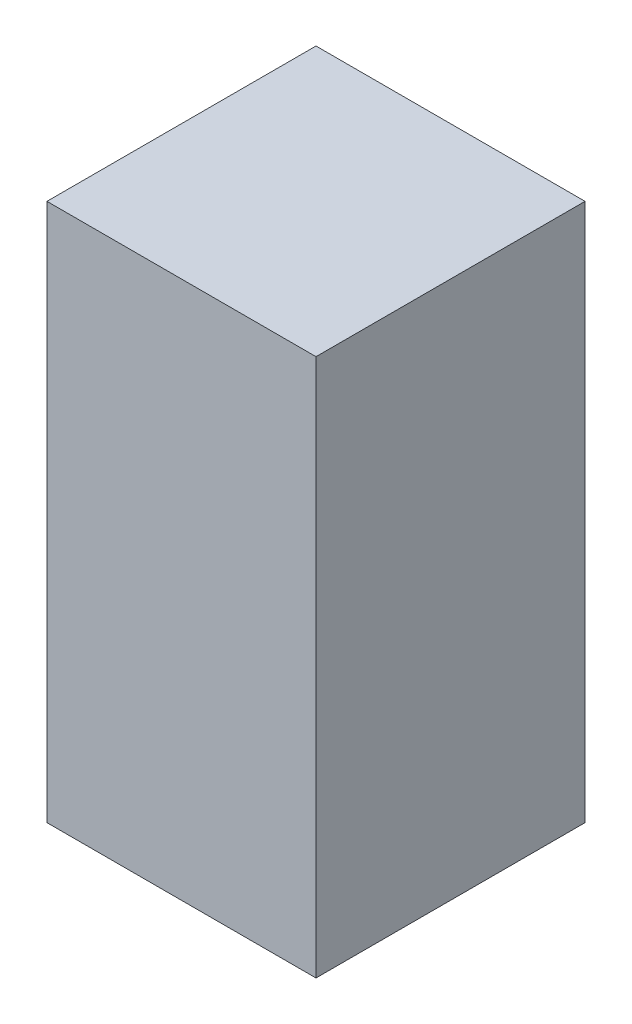
ISO-10303-21;
HEADER;
FILE_DESCRIPTION(('STEP AP214'),'2;1');
FILE_NAME('part.step','',(''),(''),'','','');
FILE_SCHEMA(('AUTOMOTIVE_DESIGN { 1 0 10303 214 1 1 1 1 }'));
ENDSEC;
DATA;
#1=APPLICATION_CONTEXT('core data for automotive mechanical design processes');
#2=APPLICATION_PROTOCOL_DEFINITION('international standard','automotive_design',2000,#1);
#3=PRODUCT_CONTEXT('',#1,'mechanical');
#4=PRODUCT('Part','Part','',(#3));
#5=PRODUCT_RELATED_PRODUCT_CATEGORY('part','',(#4));
#6=PRODUCT_DEFINITION_FORMATION('','',#4);
#7=PRODUCT_DEFINITION_CONTEXT('part definition',#1,'design');
#8=PRODUCT_DEFINITION('design','',#6,#7);
#9=PRODUCT_DEFINITION_SHAPE('','',#8);
#10=(LENGTH_UNIT() NAMED_UNIT(*) SI_UNIT(.MILLI.,.METRE.));
#11=(NAMED_UNIT(*) PLANE_ANGLE_UNIT() SI_UNIT($,.RADIAN.));
#12=(NAMED_UNIT(*) SI_UNIT($,.STERADIAN.) SOLID_ANGLE_UNIT());
#13=UNCERTAINTY_MEASURE_WITH_UNIT(LENGTH_MEASURE(1.E-05),#10,'distance_accuracy_value','');
#14=(GEOMETRIC_REPRESENTATION_CONTEXT(3) GLOBAL_UNCERTAINTY_ASSIGNED_CONTEXT((#13)) GLOBAL_UNIT_ASSIGNED_CONTEXT((#10,
#11,#12)) REPRESENTATION_CONTEXT('',''));
#15=CARTESIAN_POINT('',(0.,0.,0.));
#16=DIRECTION('',(0.,0.,1.));
#17=DIRECTION('',(1.,0.,0.));
#18=AXIS2_PLACEMENT_3D('',#15,#16,#17);
#19=CARTESIAN_POINT('',(7.24137931034483,20.,-3.33333333333334));
#20=DIRECTION('',(0.,0.,1.));
#21=DIRECTION('',(1.,0.,0.));
#22=AXIS2_PLACEMENT_3D('',#19,#20,#21);
#23=PLANE('',#22);
#24=DIRECTION('',(-1.,0.,0.));
#25=VECTOR('',#24,1.);
#26=CARTESIAN_POINT('',(7.24137931034483,0.,-3.33333333333334));
#27=LINE('',#26,#25);
#28=CARTESIAN_POINT('',(7.24137931034483,0.,-3.33333333333334));
#29=VERTEX_POINT('',#28);
#30=CARTESIAN_POINT('',(-2.75862068965517,0.,-3.33333333333334));
#31=VERTEX_POINT('',#30);
#32=EDGE_CURVE('E111',#29,#31,#27,.T.);
#33=ORIENTED_EDGE('',*,*,#32,.T.);
#34=DIRECTION('',(0.,-1.,0.));
#35=VECTOR('',#34,1.);
#36=CARTESIAN_POINT('',(-2.75862068965517,20.,-3.33333333333334));
#37=LINE('',#36,#35);
#38=CARTESIAN_POINT('',(-2.75862068965517,20.,-3.33333333333334));
#39=VERTEX_POINT('',#38);
#40=EDGE_CURVE('E11',#39,#31,#37,.T.);
#41=ORIENTED_EDGE('',*,*,#40,.F.);
#42=DIRECTION('',(-1.,0.,0.));
#43=VECTOR('',#42,1.);
#44=CARTESIAN_POINT('',(7.24137931034483,20.,-3.33333333333334));
#45=LINE('',#44,#43);
#46=CARTESIAN_POINT('',(7.24137931034483,20.,-3.33333333333334));
#47=VERTEX_POINT('',#46);
#48=EDGE_CURVE('E95',#47,#39,#45,.T.);
#49=ORIENTED_EDGE('',*,*,#48,.F.);
#50=DIRECTION('',(0.,-1.,0.));
#51=VECTOR('',#50,1.);
#52=CARTESIAN_POINT('',(7.24137931034483,20.,-3.33333333333334));
#53=LINE('',#52,#51);
#54=EDGE_CURVE('E107',#47,#29,#53,.T.);
#55=ORIENTED_EDGE('',*,*,#54,.T.);
#56=EDGE_LOOP('',(#33,#41,#49,#55));
#57=FACE_BOUND('',#56,.T.);
#58=ADVANCED_FACE('F43',(#57),#23,.F.);
#59=CARTESIAN_POINT('',(-2.75862068965517,20.,-3.33333333333334));
#60=DIRECTION('',(1.,0.,0.));
#61=DIRECTION('',(0.,0.,-1.));
#62=AXIS2_PLACEMENT_3D('',#59,#60,#61);
#63=PLANE('',#62);
#64=DIRECTION('',(0.,0.,1.));
#65=VECTOR('',#64,1.);
#66=CARTESIAN_POINT('',(-2.75862068965517,0.,-3.33333333333334));
#67=LINE('',#66,#65);
#68=CARTESIAN_POINT('',(-2.75862068965517,0.,6.66666666666666));
#69=VERTEX_POINT('',#68);
#70=EDGE_CURVE('E100',#31,#69,#67,.T.);
#71=ORIENTED_EDGE('',*,*,#70,.T.);
#72=DIRECTION('',(0.,-1.,0.));
#73=VECTOR('',#72,1.);
#74=CARTESIAN_POINT('',(-2.75862068965517,20.,6.66666666666666));
#75=LINE('',#74,#73);
#76=CARTESIAN_POINT('',(-2.75862068965517,20.,6.66666666666666));
#77=VERTEX_POINT('',#76);
#78=EDGE_CURVE('E52',#77,#69,#75,.T.);
#79=ORIENTED_EDGE('',*,*,#78,.F.);
#80=DIRECTION('',(0.,0.,1.));
#81=VECTOR('',#80,1.);
#82=CARTESIAN_POINT('',(-2.75862068965517,20.,-3.33333333333334));
#83=LINE('',#82,#81);
#84=EDGE_CURVE('E90',#39,#77,#83,.T.);
#85=ORIENTED_EDGE('',*,*,#84,.F.);
#86=ORIENTED_EDGE('',*,*,#40,.T.);
#87=EDGE_LOOP('',(#71,#79,#85,#86));
#88=FACE_BOUND('',#87,.T.);
#89=ADVANCED_FACE('F99',(#88),#63,.F.);
#90=CARTESIAN_POINT('',(-2.75862068965517,20.,6.66666666666666));
#91=DIRECTION('',(0.,0.,-1.));
#92=DIRECTION('',(-1.,0.,0.));
#93=AXIS2_PLACEMENT_3D('',#90,#91,#92);
#94=PLANE('',#93);
#95=DIRECTION('',(1.,0.,0.));
#96=VECTOR('',#95,1.);
#97=CARTESIAN_POINT('',(-2.75862068965517,0.,6.66666666666666));
#98=LINE('',#97,#96);
#99=CARTESIAN_POINT('',(7.24137931034483,0.,6.66666666666666));
#100=VERTEX_POINT('',#99);
#101=EDGE_CURVE('E77',#69,#100,#98,.T.);
#102=ORIENTED_EDGE('',*,*,#101,.T.);
#103=DIRECTION('',(0.,-1.,0.));
#104=VECTOR('',#103,1.);
#105=CARTESIAN_POINT('',(7.24137931034483,20.,6.66666666666666));
#106=LINE('',#105,#104);
#107=CARTESIAN_POINT('',(7.24137931034483,20.,6.66666666666666));
#108=VERTEX_POINT('',#107);
#109=EDGE_CURVE('E102',#108,#100,#106,.T.);
#110=ORIENTED_EDGE('',*,*,#109,.F.);
#111=DIRECTION('',(1.,0.,0.));
#112=VECTOR('',#111,1.);
#113=CARTESIAN_POINT('',(-2.75862068965517,20.,6.66666666666666));
#114=LINE('',#113,#112);
#115=EDGE_CURVE('E93',#77,#108,#114,.T.);
#116=ORIENTED_EDGE('',*,*,#115,.F.);
#117=ORIENTED_EDGE('',*,*,#78,.T.);
#118=EDGE_LOOP('',(#102,#110,#116,#117));
#119=FACE_BOUND('',#118,.T.);
#120=ADVANCED_FACE('F103',(#119),#94,.F.);
#121=CARTESIAN_POINT('',(7.24137931034483,20.,6.66666666666666));
#122=DIRECTION('',(-1.,0.,0.));
#123=DIRECTION('',(0.,0.,1.));
#124=AXIS2_PLACEMENT_3D('',#121,#122,#123);
#125=PLANE('',#124);
#126=DIRECTION('',(0.,0.,-1.));
#127=VECTOR('',#126,1.);
#128=CARTESIAN_POINT('',(7.24137931034483,0.,6.66666666666666));
#129=LINE('',#128,#127);
#130=EDGE_CURVE('E83',#100,#29,#129,.T.);
#131=ORIENTED_EDGE('',*,*,#130,.T.);
#132=ORIENTED_EDGE('',*,*,#54,.F.);
#133=DIRECTION('',(0.,0.,-1.));
#134=VECTOR('',#133,1.);
#135=CARTESIAN_POINT('',(7.24137931034483,20.,6.66666666666666));
#136=LINE('',#135,#134);
#137=EDGE_CURVE('E60',#108,#47,#136,.T.);
#138=ORIENTED_EDGE('',*,*,#137,.F.);
#139=ORIENTED_EDGE('',*,*,#109,.T.);
#140=EDGE_LOOP('',(#131,#132,#138,#139));
#141=FACE_BOUND('',#140,.T.);
#142=ADVANCED_FACE('F124',(#141),#125,.F.);
#143=CARTESIAN_POINT('',(0.,20.,0.));
#144=DIRECTION('',(0.,1.,0.));
#145=DIRECTION('',(0.,0.,1.));
#146=AXIS2_PLACEMENT_3D('',#143,#144,#145);
#147=PLANE('',#146);
#148=ORIENTED_EDGE('',*,*,#48,.T.);
#149=ORIENTED_EDGE('',*,*,#84,.T.);
#150=ORIENTED_EDGE('',*,*,#115,.T.);
#151=ORIENTED_EDGE('',*,*,#137,.T.);
#152=EDGE_LOOP('',(#148,#149,#150,#151));
#153=FACE_BOUND('',#152,.T.);
#154=ADVANCED_FACE('F91',(#153),#147,.T.);
#155=CARTESIAN_POINT('',(0.,0.,0.));
#156=DIRECTION('',(0.,1.,0.));
#157=DIRECTION('',(0.,0.,1.));
#158=AXIS2_PLACEMENT_3D('',#155,#156,#157);
#159=PLANE('',#158);
#160=ORIENTED_EDGE('',*,*,#32,.F.);
#161=ORIENTED_EDGE('',*,*,#130,.F.);
#162=ORIENTED_EDGE('',*,*,#101,.F.);
#163=ORIENTED_EDGE('',*,*,#70,.F.);
#164=EDGE_LOOP('',(#160,#161,#162,#163));
#165=FACE_BOUND('',#164,.T.);
#166=ADVANCED_FACE('F127',(#165),#159,.F.);
#167=CLOSED_SHELL('',(#58,#89,#120,#142,#154,#166));
#168=MANIFOLD_SOLID_BREP('B2',#167);
#169=ADVANCED_BREP_SHAPE_REPRESENTATION('',(#18,#168),#14);
#170=SHAPE_DEFINITION_REPRESENTATION(#9,#169);
ENDSEC;
END-ISO-10303-21;
